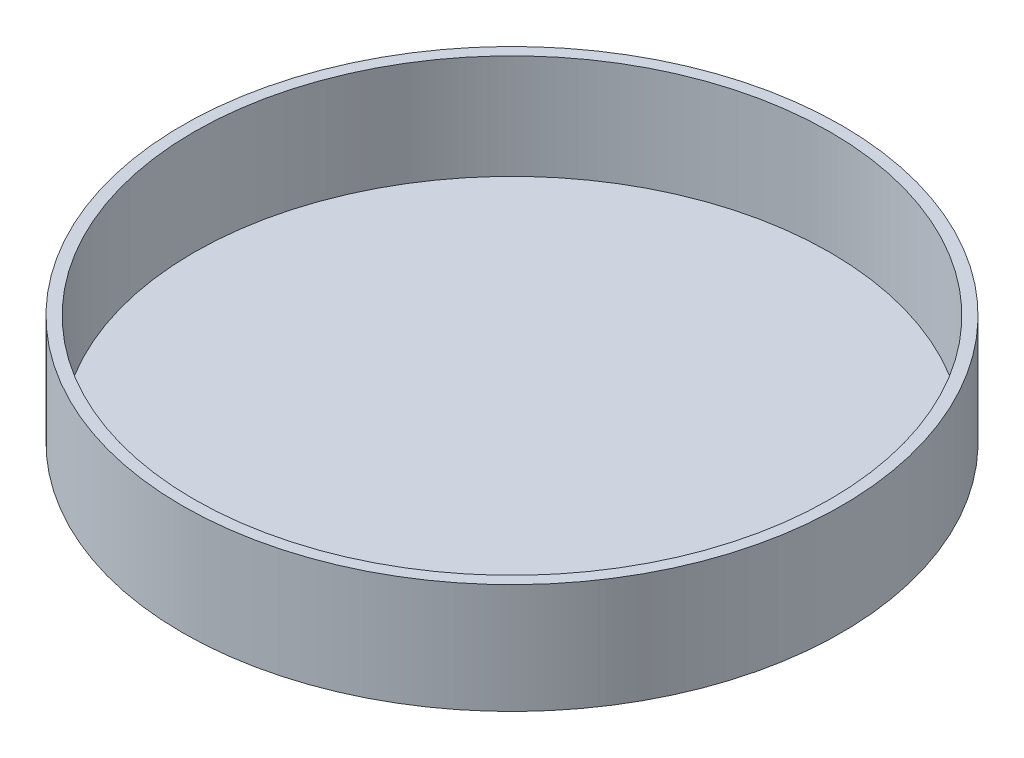
ISO-10303-21;
HEADER;
FILE_DESCRIPTION(('STEP AP214'),'2;1');
FILE_NAME('part.step','',(''),(''),'','','');
FILE_SCHEMA(('AUTOMOTIVE_DESIGN { 1 0 10303 214 1 1 1 1 }'));
ENDSEC;
DATA;
#1=APPLICATION_CONTEXT('core data for automotive mechanical design processes');
#2=APPLICATION_PROTOCOL_DEFINITION('international standard','automotive_design',2000,#1);
#3=PRODUCT_CONTEXT('',#1,'mechanical');
#4=PRODUCT('Part','Part','',(#3));
#5=PRODUCT_RELATED_PRODUCT_CATEGORY('part','',(#4));
#6=PRODUCT_DEFINITION_FORMATION('','',#4);
#7=PRODUCT_DEFINITION_CONTEXT('part definition',#1,'design');
#8=PRODUCT_DEFINITION('design','',#6,#7);
#9=PRODUCT_DEFINITION_SHAPE('','',#8);
#10=(LENGTH_UNIT() NAMED_UNIT(*) SI_UNIT(.MILLI.,.METRE.));
#11=(NAMED_UNIT(*) PLANE_ANGLE_UNIT() SI_UNIT($,.RADIAN.));
#12=(NAMED_UNIT(*) SI_UNIT($,.STERADIAN.) SOLID_ANGLE_UNIT());
#13=UNCERTAINTY_MEASURE_WITH_UNIT(LENGTH_MEASURE(1.E-05),#10,'distance_accuracy_value','');
#14=(GEOMETRIC_REPRESENTATION_CONTEXT(3) GLOBAL_UNCERTAINTY_ASSIGNED_CONTEXT((#13)) GLOBAL_UNIT_ASSIGNED_CONTEXT((#10,
#11,#12)) REPRESENTATION_CONTEXT('',''));
#15=CARTESIAN_POINT('',(0.,0.,0.));
#16=DIRECTION('',(0.,0.,1.));
#17=DIRECTION('',(1.,0.,0.));
#18=AXIS2_PLACEMENT_3D('',#15,#16,#17);
#19=CARTESIAN_POINT('',(0.,2.54,0.));
#20=DIRECTION('',(0.,-1.,0.));
#21=DIRECTION('',(0.,0.,-1.));
#22=AXIS2_PLACEMENT_3D('',#19,#20,#21);
#23=CYLINDRICAL_SURFACE('',#22,147.105988381354);
#24=CARTESIAN_POINT('',(0.,2.54,0.));
#25=DIRECTION('',(0.,-1.,0.));
#26=DIRECTION('',(0.,0.,-1.));
#27=AXIS2_PLACEMENT_3D('',#24,#25,#26);
#28=CIRCLE('',#27,147.105988381354);
#29=CARTESIAN_POINT('',(0.,2.54,-147.105988381354));
#30=VERTEX_POINT('',#29);
#31=EDGE_CURVE('E11',#30,#30,#28,.T.);
#32=ORIENTED_EDGE('',*,*,#31,.T.);
#33=EDGE_LOOP('',(#32));
#34=FACE_BOUND('',#33,.T.);
#35=CARTESIAN_POINT('',(0.,0.,0.));
#36=DIRECTION('',(0.,-1.,0.));
#37=DIRECTION('',(0.,0.,-1.));
#38=AXIS2_PLACEMENT_3D('',#35,#36,#37);
#39=CIRCLE('',#38,147.105988381354);
#40=CARTESIAN_POINT('',(0.,0.,-147.105988381354));
#41=VERTEX_POINT('',#40);
#42=EDGE_CURVE('E41',#41,#41,#39,.T.);
#43=ORIENTED_EDGE('',*,*,#42,.F.);
#44=EDGE_LOOP('',(#43));
#45=FACE_BOUND('',#44,.T.);
#46=ADVANCED_FACE('F38',(#34,#45),#23,.T.);
#47=CARTESIAN_POINT('',(0.,2.54,0.));
#48=DIRECTION('',(0.,-1.,0.));
#49=DIRECTION('',(0.,0.,-1.));
#50=AXIS2_PLACEMENT_3D('',#47,#48,#49);
#51=PLANE('',#50);
#52=ORIENTED_EDGE('',*,*,#31,.F.);
#53=EDGE_LOOP('',(#52));
#54=FACE_BOUND('',#53,.T.);
#55=ADVANCED_FACE('F53',(#54),#51,.F.);
#56=CARTESIAN_POINT('',(0.,0.,0.));
#57=DIRECTION('',(0.,-1.,0.));
#58=DIRECTION('',(0.,0.,-1.));
#59=AXIS2_PLACEMENT_3D('',#56,#57,#58);
#60=PLANE('',#59);
#61=ORIENTED_EDGE('',*,*,#42,.T.);
#62=EDGE_LOOP('',(#61));
#63=FACE_BOUND('',#62,.T.);
#64=ADVANCED_FACE('F50',(#63),#60,.T.);
#65=CLOSED_SHELL('',(#46,#55,#64));
#66=MANIFOLD_SOLID_BREP('B2',#65);
#67=CARTESIAN_POINT('',(0.,50.8,0.));
#68=DIRECTION('',(0.,1.,0.));
#69=DIRECTION('',(0.,0.,1.));
#70=AXIS2_PLACEMENT_3D('',#67,#68,#69);
#71=PLANE('',#70);
#72=CARTESIAN_POINT('',(0.,50.8,0.));
#73=DIRECTION('',(0.,1.,0.));
#74=DIRECTION('',(0.,0.,1.));
#75=AXIS2_PLACEMENT_3D('',#72,#73,#74);
#76=CIRCLE('',#75,152.4);
#77=CARTESIAN_POINT('',(0.,50.8,152.4));
#78=VERTEX_POINT('',#77);
#79=EDGE_CURVE('E37',#78,#78,#76,.T.);
#80=ORIENTED_EDGE('',*,*,#79,.T.);
#81=EDGE_LOOP('',(#80));
#82=FACE_BOUND('',#81,.T.);
#83=CARTESIAN_POINT('',(0.,50.8,0.));
#84=DIRECTION('',(0.,1.,0.));
#85=DIRECTION('',(0.,0.,1.));
#86=AXIS2_PLACEMENT_3D('',#83,#84,#85);
#87=CIRCLE('',#86,147.105988381354);
#88=CARTESIAN_POINT('',(0.,50.8,147.105988381354));
#89=VERTEX_POINT('',#88);
#90=EDGE_CURVE('E89',#89,#89,#87,.T.);
#91=ORIENTED_EDGE('',*,*,#90,.F.);
#92=EDGE_LOOP('',(#91));
#93=FACE_BOUND('',#92,.T.);
#94=ADVANCED_FACE('F78',(#82,#93),#71,.T.);
#95=CARTESIAN_POINT('',(0.,0.,0.));
#96=DIRECTION('',(0.,1.,0.));
#97=DIRECTION('',(0.,0.,1.));
#98=AXIS2_PLACEMENT_3D('',#95,#96,#97);
#99=PLANE('',#98);
#100=CARTESIAN_POINT('',(0.,0.,0.));
#101=DIRECTION('',(0.,1.,0.));
#102=DIRECTION('',(0.,0.,1.));
#103=AXIS2_PLACEMENT_3D('',#100,#101,#102);
#104=CIRCLE('',#103,152.4);
#105=CARTESIAN_POINT('',(0.,0.,152.4));
#106=VERTEX_POINT('',#105);
#107=EDGE_CURVE('E82',#106,#106,#104,.T.);
#108=ORIENTED_EDGE('',*,*,#107,.F.);
#109=EDGE_LOOP('',(#108));
#110=FACE_BOUND('',#109,.T.);
#111=CARTESIAN_POINT('',(0.,0.,0.));
#112=DIRECTION('',(0.,1.,0.));
#113=DIRECTION('',(0.,0.,1.));
#114=AXIS2_PLACEMENT_3D('',#111,#112,#113);
#115=CIRCLE('',#114,147.105988381354);
#116=CARTESIAN_POINT('',(0.,0.,147.105988381354));
#117=VERTEX_POINT('',#116);
#118=EDGE_CURVE('E91',#117,#117,#115,.T.);
#119=ORIENTED_EDGE('',*,*,#118,.T.);
#120=EDGE_LOOP('',(#119));
#121=FACE_BOUND('',#120,.T.);
#122=ADVANCED_FACE('F101',(#110,#121),#99,.F.);
#123=CARTESIAN_POINT('',(0.,50.8,0.));
#124=DIRECTION('',(0.,-1.,0.));
#125=DIRECTION('',(0.,0.,-1.));
#126=AXIS2_PLACEMENT_3D('',#123,#124,#125);
#127=CYLINDRICAL_SURFACE('',#126,152.4);
#128=ORIENTED_EDGE('',*,*,#79,.F.);
#129=EDGE_LOOP('',(#128));
#130=FACE_BOUND('',#129,.T.);
#131=ORIENTED_EDGE('',*,*,#107,.T.);
#132=EDGE_LOOP('',(#131));
#133=FACE_BOUND('',#132,.T.);
#134=ADVANCED_FACE('F80',(#130,#133),#127,.T.);
#135=CARTESIAN_POINT('',(0.,50.8,0.));
#136=DIRECTION('',(0.,-1.,0.));
#137=DIRECTION('',(0.,0.,-1.));
#138=AXIS2_PLACEMENT_3D('',#135,#136,#137);
#139=CYLINDRICAL_SURFACE('',#138,147.105988381354);
#140=ORIENTED_EDGE('',*,*,#90,.T.);
#141=EDGE_LOOP('',(#140));
#142=FACE_BOUND('',#141,.T.);
#143=ORIENTED_EDGE('',*,*,#118,.F.);
#144=EDGE_LOOP('',(#143));
#145=FACE_BOUND('',#144,.T.);
#146=ADVANCED_FACE('F97',(#142,#145),#139,.F.);
#147=CLOSED_SHELL('',(#94,#122,#134,#146));
#148=MANIFOLD_SOLID_BREP('B6',#147);
#149=ADVANCED_BREP_SHAPE_REPRESENTATION('',(#18,#66,#148),#14);
#150=SHAPE_DEFINITION_REPRESENTATION(#9,#149);
ENDSEC;
END-ISO-10303-21;
